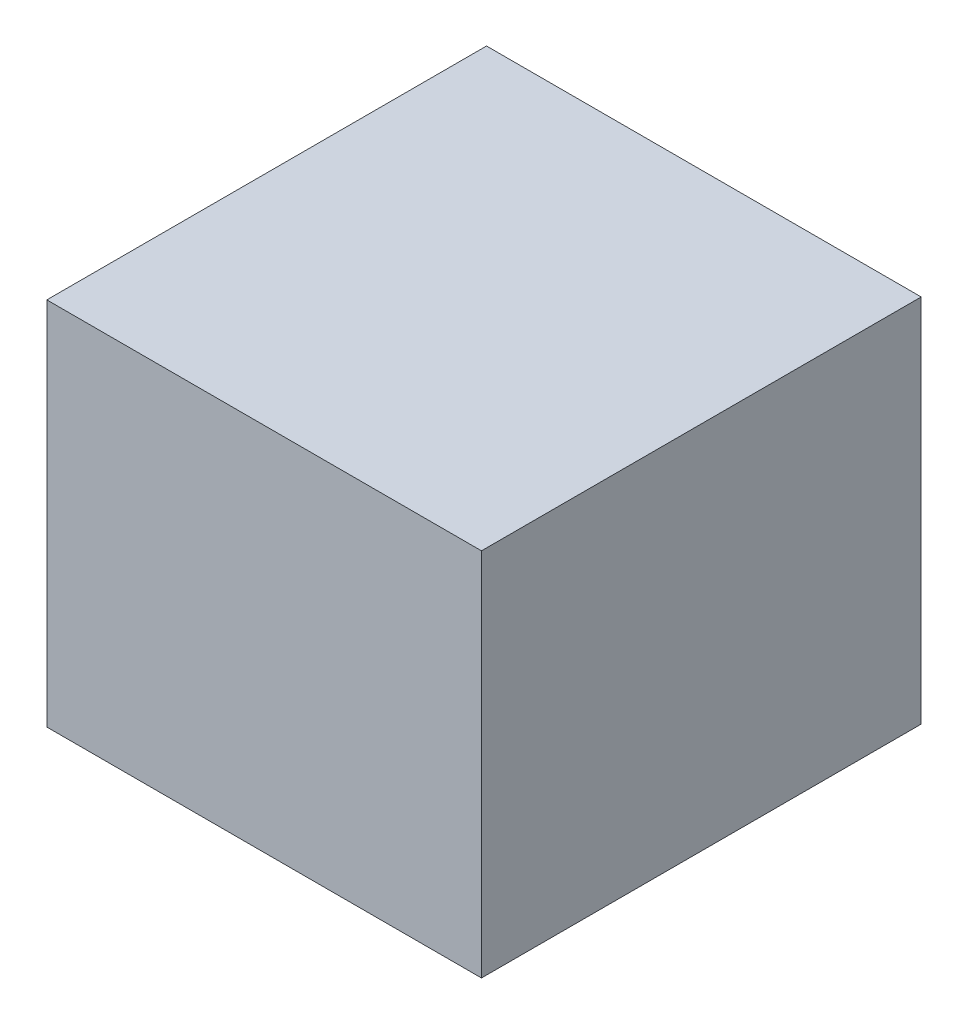
ISO-10303-21;
HEADER;
FILE_DESCRIPTION(('STEP AP214'),'2;1');
FILE_NAME('part.step','',(''),(''),'','','');
FILE_SCHEMA(('AUTOMOTIVE_DESIGN { 1 0 10303 214 1 1 1 1 }'));
ENDSEC;
DATA;
#1=APPLICATION_CONTEXT('core data for automotive mechanical design processes');
#2=APPLICATION_PROTOCOL_DEFINITION('international standard','automotive_design',2000,#1);
#3=PRODUCT_CONTEXT('',#1,'mechanical');
#4=PRODUCT('Part','Part','',(#3));
#5=PRODUCT_RELATED_PRODUCT_CATEGORY('part','',(#4));
#6=PRODUCT_DEFINITION_FORMATION('','',#4);
#7=PRODUCT_DEFINITION_CONTEXT('part definition',#1,'design');
#8=PRODUCT_DEFINITION('design','',#6,#7);
#9=PRODUCT_DEFINITION_SHAPE('','',#8);
#10=(LENGTH_UNIT() NAMED_UNIT(*) SI_UNIT(.MILLI.,.METRE.));
#11=(NAMED_UNIT(*) PLANE_ANGLE_UNIT() SI_UNIT($,.RADIAN.));
#12=(NAMED_UNIT(*) SI_UNIT($,.STERADIAN.) SOLID_ANGLE_UNIT());
#13=UNCERTAINTY_MEASURE_WITH_UNIT(LENGTH_MEASURE(1.E-05),#10,'distance_accuracy_value','');
#14=(GEOMETRIC_REPRESENTATION_CONTEXT(3) GLOBAL_UNCERTAINTY_ASSIGNED_CONTEXT((#13)) GLOBAL_UNIT_ASSIGNED_CONTEXT((#10,
#11,#12)) REPRESENTATION_CONTEXT('',''));
#15=CARTESIAN_POINT('',(0.,0.,0.));
#16=DIRECTION('',(0.,0.,1.));
#17=DIRECTION('',(1.,0.,0.));
#18=AXIS2_PLACEMENT_3D('',#15,#16,#17);
#19=CARTESIAN_POINT('',(0.,1.269999991381E-06,0.5999988));
#20=DIRECTION('',(0.,0.,-1.));
#21=DIRECTION('',(0.,-1.,0.));
#22=AXIS2_PLACEMENT_3D('',#19,#20,#21);
#23=PLANE('',#22);
#24=DIRECTION('',(0.99999999999083,4.28261855919227E-06,0.));
#25=VECTOR('',#24,1.);
#26=CARTESIAN_POINT('',(-0.29654754,0.25240996,0.5999988));
#27=LINE('',#26,#25);
#28=CARTESIAN_POINT('',(-0.29654754,0.25240996,0.5999988));
#29=VERTEX_POINT('',#28);
#30=CARTESIAN_POINT('',(0.29654754,0.2524125,0.5999988));
#31=VERTEX_POINT('',#30);
#32=EDGE_CURVE('E87',#29,#31,#27,.T.);
#33=ORIENTED_EDGE('',*,*,#32,.F.);
#34=DIRECTION('',(0.,1.,0.));
#35=VECTOR('',#34,1.);
#36=CARTESIAN_POINT('',(-0.29654754,-0.25240996,0.5999988));
#37=LINE('',#36,#35);
#38=CARTESIAN_POINT('',(-0.29654754,-0.25240996,0.5999988));
#39=VERTEX_POINT('',#38);
#40=EDGE_CURVE('E27',#39,#29,#37,.T.);
#41=ORIENTED_EDGE('',*,*,#40,.F.);
#42=DIRECTION('',(-0.99999999999083,-4.28261860711327E-06,0.));
#43=VECTOR('',#42,1.);
#44=CARTESIAN_POINT('',(0.29654754,-0.25240742,0.5999988));
#45=LINE('',#44,#43);
#46=CARTESIAN_POINT('',(0.29654754,-0.25240742,0.5999988));
#47=VERTEX_POINT('',#46);
#48=EDGE_CURVE('E104',#47,#39,#45,.T.);
#49=ORIENTED_EDGE('',*,*,#48,.F.);
#50=DIRECTION('',(0.,-1.,0.));
#51=VECTOR('',#50,1.);
#52=CARTESIAN_POINT('',(0.29654754,0.2524125,0.5999988));
#53=LINE('',#52,#51);
#54=EDGE_CURVE('E84',#31,#47,#53,.T.);
#55=ORIENTED_EDGE('',*,*,#54,.F.);
#56=EDGE_LOOP('',(#33,#41,#49,#55));
#57=FACE_BOUND('',#56,.T.);
#58=ADVANCED_FACE('F16',(#57),#23,.F.);
#59=CARTESIAN_POINT('',(0.,1.269999991381E-06,0.));
#60=DIRECTION('',(0.,0.,-1.));
#61=DIRECTION('',(0.,-1.,0.));
#62=AXIS2_PLACEMENT_3D('',#59,#60,#61);
#63=PLANE('',#62);
#64=DIRECTION('',(0.99999999999083,4.28261855919227E-06,0.));
#65=VECTOR('',#64,1.);
#66=CARTESIAN_POINT('',(-0.29654754,0.25240996,0.));
#67=LINE('',#66,#65);
#68=CARTESIAN_POINT('',(-0.29654754,0.25240996,0.));
#69=VERTEX_POINT('',#68);
#70=CARTESIAN_POINT('',(0.29654754,0.2524125,0.));
#71=VERTEX_POINT('',#70);
#72=EDGE_CURVE('E72',#69,#71,#67,.T.);
#73=ORIENTED_EDGE('',*,*,#72,.T.);
#74=DIRECTION('',(0.,-1.,0.));
#75=VECTOR('',#74,1.);
#76=CARTESIAN_POINT('',(0.29654754,0.2524125,0.));
#77=LINE('',#76,#75);
#78=CARTESIAN_POINT('',(0.29654754,-0.25240742,0.));
#79=VERTEX_POINT('',#78);
#80=EDGE_CURVE('E101',#71,#79,#77,.T.);
#81=ORIENTED_EDGE('',*,*,#80,.T.);
#82=DIRECTION('',(-0.99999999999083,-4.28261860711327E-06,0.));
#83=VECTOR('',#82,1.);
#84=CARTESIAN_POINT('',(0.29654754,-0.25240742,0.));
#85=LINE('',#84,#83);
#86=CARTESIAN_POINT('',(-0.29654754,-0.25240996,0.));
#87=VERTEX_POINT('',#86);
#88=EDGE_CURVE('E74',#79,#87,#85,.T.);
#89=ORIENTED_EDGE('',*,*,#88,.T.);
#90=DIRECTION('',(0.,1.,0.));
#91=VECTOR('',#90,1.);
#92=CARTESIAN_POINT('',(-0.29654754,-0.25240996,0.));
#93=LINE('',#92,#91);
#94=EDGE_CURVE('E11',#87,#69,#93,.T.);
#95=ORIENTED_EDGE('',*,*,#94,.T.);
#96=EDGE_LOOP('',(#73,#81,#89,#95));
#97=FACE_BOUND('',#96,.T.);
#98=ADVANCED_FACE('F70',(#97),#63,.T.);
#99=CARTESIAN_POINT('',(-0.29654754,-0.25240996,0.));
#100=DIRECTION('',(-1.,0.,0.));
#101=DIRECTION('',(0.,0.,1.));
#102=AXIS2_PLACEMENT_3D('',#99,#100,#101);
#103=PLANE('',#102);
#104=DIRECTION('',(0.,0.,1.));
#105=VECTOR('',#104,1.);
#106=CARTESIAN_POINT('',(-0.29654754,-0.25240996,0.));
#107=LINE('',#106,#105);
#108=EDGE_CURVE('E96',#87,#39,#107,.T.);
#109=ORIENTED_EDGE('',*,*,#108,.T.);
#110=ORIENTED_EDGE('',*,*,#40,.T.);
#111=DIRECTION('',(0.,0.,1.));
#112=VECTOR('',#111,1.);
#113=CARTESIAN_POINT('',(-0.29654754,0.25240996,0.));
#114=LINE('',#113,#112);
#115=EDGE_CURVE('E80',#69,#29,#114,.T.);
#116=ORIENTED_EDGE('',*,*,#115,.F.);
#117=ORIENTED_EDGE('',*,*,#94,.F.);
#118=EDGE_LOOP('',(#109,#110,#116,#117));
#119=FACE_BOUND('',#118,.T.);
#120=ADVANCED_FACE('F85',(#119),#103,.T.);
#121=CARTESIAN_POINT('',(0.29654754,-0.25240742,0.));
#122=DIRECTION('',(4.28261860711327E-06,-0.99999999999083,0.));
#123=DIRECTION('',(0.,0.,-1.));
#124=AXIS2_PLACEMENT_3D('',#121,#122,#123);
#125=PLANE('',#124);
#126=DIRECTION('',(0.,0.,1.));
#127=VECTOR('',#126,1.);
#128=CARTESIAN_POINT('',(0.29654754,-0.25240742,0.));
#129=LINE('',#128,#127);
#130=EDGE_CURVE('E20',#79,#47,#129,.T.);
#131=ORIENTED_EDGE('',*,*,#130,.T.);
#132=ORIENTED_EDGE('',*,*,#48,.T.);
#133=ORIENTED_EDGE('',*,*,#108,.F.);
#134=ORIENTED_EDGE('',*,*,#88,.F.);
#135=EDGE_LOOP('',(#131,#132,#133,#134));
#136=FACE_BOUND('',#135,.T.);
#137=ADVANCED_FACE('F18',(#136),#125,.T.);
#138=CARTESIAN_POINT('',(0.29654754,0.2524125,0.));
#139=DIRECTION('',(1.,0.,0.));
#140=DIRECTION('',(0.,1.,0.));
#141=AXIS2_PLACEMENT_3D('',#138,#139,#140);
#142=PLANE('',#141);
#143=DIRECTION('',(0.,0.,1.));
#144=VECTOR('',#143,1.);
#145=CARTESIAN_POINT('',(0.29654754,0.2524125,0.));
#146=LINE('',#145,#144);
#147=EDGE_CURVE('E82',#71,#31,#146,.T.);
#148=ORIENTED_EDGE('',*,*,#147,.T.);
#149=ORIENTED_EDGE('',*,*,#54,.T.);
#150=ORIENTED_EDGE('',*,*,#130,.F.);
#151=ORIENTED_EDGE('',*,*,#80,.F.);
#152=EDGE_LOOP('',(#148,#149,#150,#151));
#153=FACE_BOUND('',#152,.T.);
#154=ADVANCED_FACE('F121',(#153),#142,.T.);
#155=CARTESIAN_POINT('',(-0.29654754,0.25240996,0.));
#156=DIRECTION('',(-4.28261855919227E-06,0.99999999999083,0.));
#157=DIRECTION('',(0.,0.,1.));
#158=AXIS2_PLACEMENT_3D('',#155,#156,#157);
#159=PLANE('',#158);
#160=ORIENTED_EDGE('',*,*,#115,.T.);
#161=ORIENTED_EDGE('',*,*,#32,.T.);
#162=ORIENTED_EDGE('',*,*,#147,.F.);
#163=ORIENTED_EDGE('',*,*,#72,.F.);
#164=EDGE_LOOP('',(#160,#161,#162,#163));
#165=FACE_BOUND('',#164,.T.);
#166=ADVANCED_FACE('F78',(#165),#159,.T.);
#167=CLOSED_SHELL('',(#58,#98,#120,#137,#154,#166));
#168=MANIFOLD_SOLID_BREP('B1',#167);
#169=ADVANCED_BREP_SHAPE_REPRESENTATION('',(#18,#168),#14);
#170=SHAPE_DEFINITION_REPRESENTATION(#9,#169);
ENDSEC;
END-ISO-10303-21;
